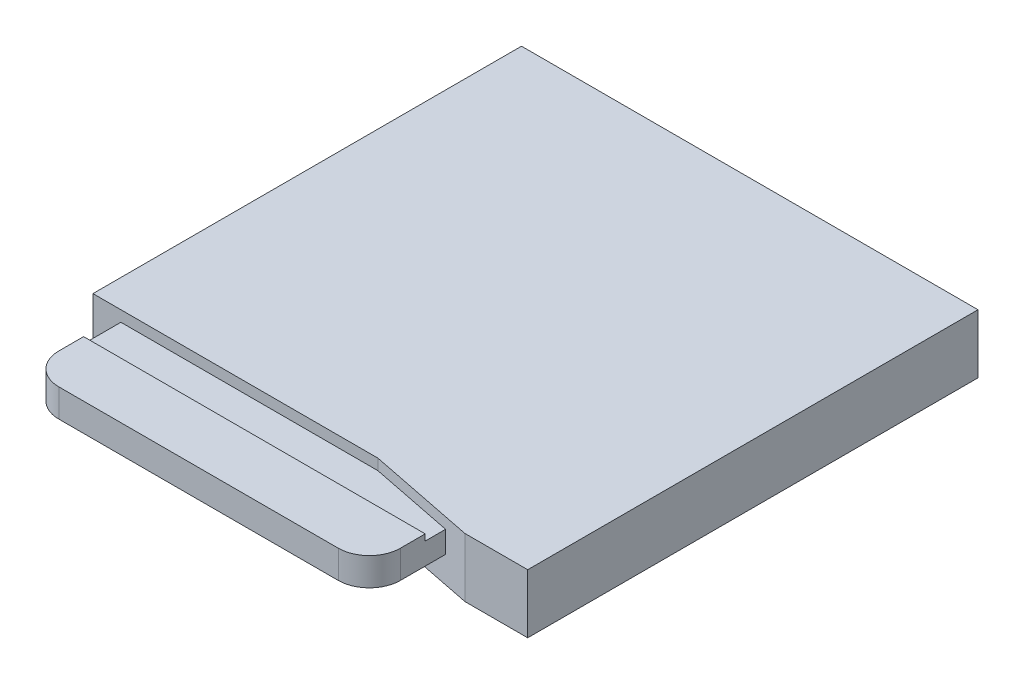
ISO-10303-21;
HEADER;
FILE_DESCRIPTION(('STEP AP214'),'2;1');
FILE_NAME('part.step','',(''),(''),'','','');
FILE_SCHEMA(('AUTOMOTIVE_DESIGN { 1 0 10303 214 1 1 1 1 }'));
ENDSEC;
DATA;
#1=APPLICATION_CONTEXT('core data for automotive mechanical design processes');
#2=APPLICATION_PROTOCOL_DEFINITION('international standard','automotive_design',2000,#1);
#3=PRODUCT_CONTEXT('',#1,'mechanical');
#4=PRODUCT('Part','Part','',(#3));
#5=PRODUCT_RELATED_PRODUCT_CATEGORY('part','',(#4));
#6=PRODUCT_DEFINITION_FORMATION('','',#4);
#7=PRODUCT_DEFINITION_CONTEXT('part definition',#1,'design');
#8=PRODUCT_DEFINITION('design','',#6,#7);
#9=PRODUCT_DEFINITION_SHAPE('','',#8);
#10=(LENGTH_UNIT() NAMED_UNIT(*) SI_UNIT(.MILLI.,.METRE.));
#11=(NAMED_UNIT(*) PLANE_ANGLE_UNIT() SI_UNIT($,.RADIAN.));
#12=(NAMED_UNIT(*) SI_UNIT($,.STERADIAN.) SOLID_ANGLE_UNIT());
#13=UNCERTAINTY_MEASURE_WITH_UNIT(LENGTH_MEASURE(1.E-05),#10,'distance_accuracy_value','');
#14=(GEOMETRIC_REPRESENTATION_CONTEXT(3) GLOBAL_UNCERTAINTY_ASSIGNED_CONTEXT((#13)) GLOBAL_UNIT_ASSIGNED_CONTEXT((#10,
#11,#12)) REPRESENTATION_CONTEXT('',''));
#15=CARTESIAN_POINT('',(0.,0.,0.));
#16=DIRECTION('',(0.,0.,1.));
#17=DIRECTION('',(1.,0.,0.));
#18=AXIS2_PLACEMENT_3D('',#15,#16,#17);
#19=CARTESIAN_POINT('',(-6.45,1.55,9.55));
#20=DIRECTION('',(0.,-1.,0.));
#21=DIRECTION('',(1.,0.,0.));
#22=AXIS2_PLACEMENT_3D('',#19,#20,#21);
#23=PLANE('',#22);
#24=DIRECTION('',(-1.,0.,0.));
#25=VECTOR('',#24,1.);
#26=CARTESIAN_POINT('',(-6.45,1.55,7.75));
#27=LINE('',#26,#25);
#28=CARTESIAN_POINT('',(4.55,1.55,7.75));
#29=VERTEX_POINT('',#28);
#30=CARTESIAN_POINT('',(-6.45,1.55,7.75));
#31=VERTEX_POINT('',#30);
#32=EDGE_CURVE('E176',#29,#31,#27,.T.);
#33=ORIENTED_EDGE('',*,*,#32,.F.);
#34=DIRECTION('',(0.,0.,-1.));
#35=VECTOR('',#34,1.);
#36=CARTESIAN_POINT('',(4.55,1.55,9.55));
#37=LINE('',#36,#35);
#38=CARTESIAN_POINT('',(4.55,1.55,7.0944663786975));
#39=VERTEX_POINT('',#38);
#40=EDGE_CURVE('E161',#29,#39,#37,.T.);
#41=ORIENTED_EDGE('',*,*,#40,.T.);
#42=DIRECTION('',(-0.980618969510465,0.,-0.195924568740712));
#43=VECTOR('',#42,1.);
#44=CARTESIAN_POINT('',(1.82489991355795,1.55,6.55));
#45=LINE('',#44,#43);
#46=CARTESIAN_POINT('',(1.82489991355794,1.55000000000001,6.55));
#47=VERTEX_POINT('',#46);
#48=EDGE_CURVE('E203',#39,#47,#45,.T.);
#49=ORIENTED_EDGE('',*,*,#48,.T.);
#50=DIRECTION('',(-1.,0.,0.));
#51=VECTOR('',#50,1.);
#52=CARTESIAN_POINT('',(-7.35,1.55,6.55));
#53=LINE('',#52,#51);
#54=CARTESIAN_POINT('',(-6.45,1.55,6.55));
#55=VERTEX_POINT('',#54);
#56=EDGE_CURVE('E278',#47,#55,#53,.T.);
#57=ORIENTED_EDGE('',*,*,#56,.T.);
#58=DIRECTION('',(0.,0.,-1.));
#59=VECTOR('',#58,1.);
#60=CARTESIAN_POINT('',(-6.45,1.55,9.55));
#61=LINE('',#60,#59);
#62=EDGE_CURVE('E185',#31,#55,#61,.T.);
#63=ORIENTED_EDGE('',*,*,#62,.F.);
#64=EDGE_LOOP('',(#33,#41,#49,#57,#63));
#65=FACE_BOUND('',#64,.T.);
#66=ADVANCED_FACE('F39',(#65),#23,.F.);
#67=CARTESIAN_POINT('',(1.82489991355794,30.1940446390294,6.55));
#68=DIRECTION('',(0.195924568740712,0.,-0.980618969510465));
#69=DIRECTION('',(-0.980618969510465,0.,-0.195924568740712));
#70=AXIS2_PLACEMENT_3D('',#67,#68,#69);
#71=PLANE('',#70);
#72=DIRECTION('',(0.980618969510465,0.,0.195924568740712));
#73=VECTOR('',#72,1.);
#74=CARTESIAN_POINT('',(1.82489991355795,0.850000000000004,6.55));
#75=LINE('',#74,#73);
#76=CARTESIAN_POINT('',(1.82489991355794,0.850000000000011,6.55));
#77=VERTEX_POINT('',#76);
#78=CARTESIAN_POINT('',(4.55,0.850000000000004,7.0944663786975));
#79=VERTEX_POINT('',#78);
#80=EDGE_CURVE('E207',#77,#79,#75,.T.);
#81=ORIENTED_EDGE('',*,*,#80,.F.);
#82=DIRECTION('',(0.,-1.,0.));
#83=VECTOR('',#82,1.);
#84=CARTESIAN_POINT('',(1.82489991355794,30.1940446390294,6.55));
#85=LINE('',#84,#83);
#86=CARTESIAN_POINT('',(1.82489991355794,0.,6.55));
#87=VERTEX_POINT('',#86);
#88=EDGE_CURVE('E233',#77,#87,#85,.T.);
#89=ORIENTED_EDGE('',*,*,#88,.T.);
#90=DIRECTION('',(-0.980618969510465,0.,-0.195924568740712));
#91=VECTOR('',#90,1.);
#92=CARTESIAN_POINT('',(1.82489991355794,0.,6.55));
#93=LINE('',#92,#91);
#94=CARTESIAN_POINT('',(5.32845887540388,0.,7.25));
#95=VERTEX_POINT('',#94);
#96=EDGE_CURVE('E212',#95,#87,#93,.T.);
#97=ORIENTED_EDGE('',*,*,#96,.F.);
#98=DIRECTION('',(0.,-1.,0.));
#99=VECTOR('',#98,1.);
#100=CARTESIAN_POINT('',(5.3284588754039,30.1940446390294,7.25));
#101=LINE('',#100,#99);
#102=CARTESIAN_POINT('',(5.3284588754039,1.90000000000001,7.25));
#103=VERTEX_POINT('',#102);
#104=EDGE_CURVE('E229',#103,#95,#101,.T.);
#105=ORIENTED_EDGE('',*,*,#104,.F.);
#106=DIRECTION('',(-0.980618969510465,0.,-0.195924568740712));
#107=VECTOR('',#106,1.);
#108=CARTESIAN_POINT('',(1.82489991355794,1.9,6.55));
#109=LINE('',#108,#107);
#110=CARTESIAN_POINT('',(1.82489991355794,1.90000000000001,6.55));
#111=VERTEX_POINT('',#110);
#112=EDGE_CURVE('E211',#103,#111,#109,.T.);
#113=ORIENTED_EDGE('',*,*,#112,.T.);
#114=EDGE_CURVE('E234',#111,#47,#85,.T.);
#115=ORIENTED_EDGE('',*,*,#114,.T.);
#116=ORIENTED_EDGE('',*,*,#48,.F.);
#117=DIRECTION('',(0.,1.,0.));
#118=VECTOR('',#117,1.);
#119=CARTESIAN_POINT('',(4.55,30.1940446390294,7.0944663786975));
#120=LINE('',#119,#118);
#121=EDGE_CURVE('E282',#79,#39,#120,.T.);
#122=ORIENTED_EDGE('',*,*,#121,.F.);
#123=EDGE_LOOP('',(#81,#89,#97,#105,#113,#115,#116,#122));
#124=FACE_BOUND('',#123,.T.);
#125=ADVANCED_FACE('F332',(#124),#71,.F.);
#126=CARTESIAN_POINT('',(-7.35,30.1940446390294,6.55));
#127=DIRECTION('',(0.,0.,-1.));
#128=DIRECTION('',(-1.,0.,0.));
#129=AXIS2_PLACEMENT_3D('',#126,#127,#128);
#130=PLANE('',#129);
#131=DIRECTION('',(1.,0.,0.));
#132=VECTOR('',#131,1.);
#133=CARTESIAN_POINT('',(-6.45,0.850000000000002,6.55));
#134=LINE('',#133,#132);
#135=CARTESIAN_POINT('',(-6.45,0.850000000000004,6.55));
#136=VERTEX_POINT('',#135);
#137=EDGE_CURVE('E186',#136,#77,#134,.T.);
#138=ORIENTED_EDGE('',*,*,#137,.F.);
#139=DIRECTION('',(0.,-1.,0.));
#140=VECTOR('',#139,1.);
#141=CARTESIAN_POINT('',(-6.45,1.55,6.55));
#142=LINE('',#141,#140);
#143=EDGE_CURVE('E165',#55,#136,#142,.T.);
#144=ORIENTED_EDGE('',*,*,#143,.F.);
#145=ORIENTED_EDGE('',*,*,#56,.F.);
#146=ORIENTED_EDGE('',*,*,#114,.F.);
#147=DIRECTION('',(-1.,0.,0.));
#148=VECTOR('',#147,1.);
#149=CARTESIAN_POINT('',(-7.35,1.9,6.55));
#150=LINE('',#149,#148);
#151=CARTESIAN_POINT('',(-7.35,1.90000000000001,6.55));
#152=VERTEX_POINT('',#151);
#153=EDGE_CURVE('E221',#111,#152,#150,.T.);
#154=ORIENTED_EDGE('',*,*,#153,.T.);
#155=DIRECTION('',(0.,-1.,0.));
#156=VECTOR('',#155,1.);
#157=CARTESIAN_POINT('',(-7.35,30.1940446390294,6.55));
#158=LINE('',#157,#156);
#159=CARTESIAN_POINT('',(-7.35,0.,6.55));
#160=VERTEX_POINT('',#159);
#161=EDGE_CURVE('E216',#152,#160,#158,.T.);
#162=ORIENTED_EDGE('',*,*,#161,.T.);
#163=DIRECTION('',(-1.,0.,0.));
#164=VECTOR('',#163,1.);
#165=CARTESIAN_POINT('',(-7.35,0.,6.55));
#166=LINE('',#165,#164);
#167=EDGE_CURVE('E217',#87,#160,#166,.T.);
#168=ORIENTED_EDGE('',*,*,#167,.F.);
#169=ORIENTED_EDGE('',*,*,#88,.F.);
#170=EDGE_LOOP('',(#138,#144,#145,#146,#154,#162,#168,#169));
#171=FACE_BOUND('',#170,.T.);
#172=ADVANCED_FACE('F338',(#171),#130,.F.);
#173=CARTESIAN_POINT('',(0.,0.,0.));
#174=DIRECTION('',(0.,-1.,0.));
#175=DIRECTION('',(0.,0.,-1.));
#176=AXIS2_PLACEMENT_3D('',#173,#174,#175);
#177=PLANE('',#176);
#178=CARTESIAN_POINT('',(3.05,0.,3.25));
#179=DIRECTION('',(0.,-1.,0.));
#180=DIRECTION('',(0.,0.,-1.));
#181=AXIS2_PLACEMENT_3D('',#178,#179,#180);
#182=CIRCLE('',#181,0.4);
#183=CARTESIAN_POINT('',(3.05,0.,2.85));
#184=VERTEX_POINT('',#183);
#185=EDGE_CURVE('E430',#184,#184,#182,.T.);
#186=ORIENTED_EDGE('',*,*,#185,.F.);
#187=EDGE_LOOP('',(#186));
#188=FACE_BOUND('',#187,.T.);
#189=CARTESIAN_POINT('',(-4.95,0.,3.25));
#190=DIRECTION('',(0.,-1.,0.));
#191=DIRECTION('',(0.,0.,-1.));
#192=AXIS2_PLACEMENT_3D('',#189,#190,#191);
#193=CIRCLE('',#192,0.4);
#194=CARTESIAN_POINT('',(-4.95,0.,2.85));
#195=VERTEX_POINT('',#194);
#196=EDGE_CURVE('E179',#195,#195,#193,.T.);
#197=ORIENTED_EDGE('',*,*,#196,.F.);
#198=EDGE_LOOP('',(#197));
#199=FACE_BOUND('',#198,.T.);
#200=ORIENTED_EDGE('',*,*,#96,.T.);
#201=ORIENTED_EDGE('',*,*,#167,.T.);
#202=DIRECTION('',(0.,0.,1.));
#203=VECTOR('',#202,1.);
#204=CARTESIAN_POINT('',(-7.35,0.,7.25));
#205=LINE('',#204,#203);
#206=CARTESIAN_POINT('',(-7.35,0.,-7.25));
#207=VERTEX_POINT('',#206);
#208=EDGE_CURVE('E261',#207,#160,#205,.T.);
#209=ORIENTED_EDGE('',*,*,#208,.F.);
#210=DIRECTION('',(-1.,0.,0.));
#211=VECTOR('',#210,1.);
#212=CARTESIAN_POINT('',(-7.35,0.,-7.25));
#213=LINE('',#212,#211);
#214=CARTESIAN_POINT('',(7.35,0.,-7.25));
#215=VERTEX_POINT('',#214);
#216=EDGE_CURVE('E258',#215,#207,#213,.T.);
#217=ORIENTED_EDGE('',*,*,#216,.F.);
#218=DIRECTION('',(0.,0.,-1.));
#219=VECTOR('',#218,1.);
#220=CARTESIAN_POINT('',(7.35,0.,7.25));
#221=LINE('',#220,#219);
#222=CARTESIAN_POINT('',(7.35,0.,7.25));
#223=VERTEX_POINT('',#222);
#224=EDGE_CURVE('E238',#223,#215,#221,.T.);
#225=ORIENTED_EDGE('',*,*,#224,.F.);
#226=DIRECTION('',(1.,0.,0.));
#227=VECTOR('',#226,1.);
#228=CARTESIAN_POINT('',(-7.35,0.,7.25));
#229=LINE('',#228,#227);
#230=EDGE_CURVE('E244',#95,#223,#229,.T.);
#231=ORIENTED_EDGE('',*,*,#230,.F.);
#232=EDGE_LOOP('',(#200,#201,#209,#217,#225,#231));
#233=FACE_BOUND('',#232,.T.);
#234=ADVANCED_FACE('F356',(#188,#199,#233),#177,.T.);
#235=CARTESIAN_POINT('',(7.35,1.9,7.25));
#236=DIRECTION('',(-1.,0.,0.));
#237=DIRECTION('',(0.,0.,1.));
#238=AXIS2_PLACEMENT_3D('',#235,#236,#237);
#239=PLANE('',#238);
#240=ORIENTED_EDGE('',*,*,#224,.T.);
#241=DIRECTION('',(0.,-1.,0.));
#242=VECTOR('',#241,1.);
#243=CARTESIAN_POINT('',(7.35,1.9,-7.25));
#244=LINE('',#243,#242);
#245=CARTESIAN_POINT('',(7.35,1.9,-7.25));
#246=VERTEX_POINT('',#245);
#247=EDGE_CURVE('E274',#246,#215,#244,.T.);
#248=ORIENTED_EDGE('',*,*,#247,.F.);
#249=DIRECTION('',(0.,0.,-1.));
#250=VECTOR('',#249,1.);
#251=CARTESIAN_POINT('',(7.35,1.9,7.25));
#252=LINE('',#251,#250);
#253=CARTESIAN_POINT('',(7.35,1.9,7.25));
#254=VERTEX_POINT('',#253);
#255=EDGE_CURVE('E239',#254,#246,#252,.T.);
#256=ORIENTED_EDGE('',*,*,#255,.F.);
#257=DIRECTION('',(0.,-1.,0.));
#258=VECTOR('',#257,1.);
#259=CARTESIAN_POINT('',(7.35,1.9,7.25));
#260=LINE('',#259,#258);
#261=EDGE_CURVE('E254',#254,#223,#260,.T.);
#262=ORIENTED_EDGE('',*,*,#261,.T.);
#263=EDGE_LOOP('',(#240,#248,#256,#262));
#264=FACE_BOUND('',#263,.T.);
#265=ADVANCED_FACE('F365',(#264),#239,.F.);
#266=CARTESIAN_POINT('',(-7.35,1.9,-7.25));
#267=DIRECTION('',(0.,0.,1.));
#268=DIRECTION('',(1.,0.,0.));
#269=AXIS2_PLACEMENT_3D('',#266,#267,#268);
#270=PLANE('',#269);
#271=ORIENTED_EDGE('',*,*,#216,.T.);
#272=DIRECTION('',(0.,-1.,0.));
#273=VECTOR('',#272,1.);
#274=CARTESIAN_POINT('',(-7.35,1.9,-7.25));
#275=LINE('',#274,#273);
#276=CARTESIAN_POINT('',(-7.35,1.9,-7.25));
#277=VERTEX_POINT('',#276);
#278=EDGE_CURVE('E270',#277,#207,#275,.T.);
#279=ORIENTED_EDGE('',*,*,#278,.F.);
#280=DIRECTION('',(-1.,0.,0.));
#281=VECTOR('',#280,1.);
#282=CARTESIAN_POINT('',(-7.35,1.9,-7.25));
#283=LINE('',#282,#281);
#284=EDGE_CURVE('E243',#246,#277,#283,.T.);
#285=ORIENTED_EDGE('',*,*,#284,.F.);
#286=ORIENTED_EDGE('',*,*,#247,.T.);
#287=EDGE_LOOP('',(#271,#279,#285,#286));
#288=FACE_BOUND('',#287,.T.);
#289=ADVANCED_FACE('F373',(#288),#270,.F.);
#290=CARTESIAN_POINT('',(-7.35,1.9,7.25));
#291=DIRECTION('',(1.,0.,0.));
#292=DIRECTION('',(0.,0.,-1.));
#293=AXIS2_PLACEMENT_3D('',#290,#291,#292);
#294=PLANE('',#293);
#295=ORIENTED_EDGE('',*,*,#208,.T.);
#296=ORIENTED_EDGE('',*,*,#161,.F.);
#297=DIRECTION('',(0.,0.,1.));
#298=VECTOR('',#297,1.);
#299=CARTESIAN_POINT('',(-7.35,1.9,7.25));
#300=LINE('',#299,#298);
#301=EDGE_CURVE('E247',#277,#152,#300,.T.);
#302=ORIENTED_EDGE('',*,*,#301,.F.);
#303=ORIENTED_EDGE('',*,*,#278,.T.);
#304=EDGE_LOOP('',(#295,#296,#302,#303));
#305=FACE_BOUND('',#304,.T.);
#306=ADVANCED_FACE('F369',(#305),#294,.F.);
#307=CARTESIAN_POINT('',(-7.35,1.9,7.25));
#308=DIRECTION('',(0.,0.,-1.));
#309=DIRECTION('',(-1.,0.,0.));
#310=AXIS2_PLACEMENT_3D('',#307,#308,#309);
#311=PLANE('',#310);
#312=DIRECTION('',(1.,0.,0.));
#313=VECTOR('',#312,1.);
#314=CARTESIAN_POINT('',(-7.35,1.9,7.25));
#315=LINE('',#314,#313);
#316=EDGE_CURVE('E251',#103,#254,#315,.T.);
#317=ORIENTED_EDGE('',*,*,#316,.F.);
#318=ORIENTED_EDGE('',*,*,#104,.T.);
#319=ORIENTED_EDGE('',*,*,#230,.T.);
#320=ORIENTED_EDGE('',*,*,#261,.F.);
#321=EDGE_LOOP('',(#317,#318,#319,#320));
#322=FACE_BOUND('',#321,.T.);
#323=ADVANCED_FACE('F361',(#322),#311,.F.);
#324=CARTESIAN_POINT('',(0.,1.9,0.));
#325=DIRECTION('',(0.,-1.,0.));
#326=DIRECTION('',(0.,0.,-1.));
#327=AXIS2_PLACEMENT_3D('',#324,#325,#326);
#328=PLANE('',#327);
#329=ORIENTED_EDGE('',*,*,#153,.F.);
#330=ORIENTED_EDGE('',*,*,#112,.F.);
#331=ORIENTED_EDGE('',*,*,#316,.T.);
#332=ORIENTED_EDGE('',*,*,#255,.T.);
#333=ORIENTED_EDGE('',*,*,#284,.T.);
#334=ORIENTED_EDGE('',*,*,#301,.T.);
#335=EDGE_LOOP('',(#329,#330,#331,#332,#333,#334));
#336=FACE_BOUND('',#335,.T.);
#337=ADVANCED_FACE('F348',(#336),#328,.F.);
#338=CARTESIAN_POINT('',(4.55,1.55,9.55));
#339=DIRECTION('',(-1.,0.,0.));
#340=DIRECTION('',(0.,0.,1.));
#341=AXIS2_PLACEMENT_3D('',#338,#339,#340);
#342=PLANE('',#341);
#343=DIRECTION('',(0.,0.,-1.));
#344=VECTOR('',#343,1.);
#345=CARTESIAN_POINT('',(4.55,1.75,9.55));
#346=LINE('',#345,#344);
#347=CARTESIAN_POINT('',(4.55,1.75,8.55));
#348=VERTEX_POINT('',#347);
#349=CARTESIAN_POINT('',(4.55,1.75,7.75));
#350=VERTEX_POINT('',#349);
#351=EDGE_CURVE('E146',#348,#350,#346,.T.);
#352=ORIENTED_EDGE('',*,*,#351,.F.);
#353=DIRECTION('',(0.,1.,0.));
#354=VECTOR('',#353,1.);
#355=CARTESIAN_POINT('',(4.55,0.850000000000004,8.55));
#356=LINE('',#355,#354);
#357=CARTESIAN_POINT('',(4.55,0.850000000000004,8.55));
#358=VERTEX_POINT('',#357);
#359=EDGE_CURVE('E306',#348,#358,#356,.F.);
#360=ORIENTED_EDGE('',*,*,#359,.T.);
#361=DIRECTION('',(0.,0.,-1.));
#362=VECTOR('',#361,1.);
#363=CARTESIAN_POINT('',(4.55,0.850000000000004,9.55));
#364=LINE('',#363,#362);
#365=EDGE_CURVE('E197',#358,#79,#364,.T.);
#366=ORIENTED_EDGE('',*,*,#365,.T.);
#367=ORIENTED_EDGE('',*,*,#121,.T.);
#368=ORIENTED_EDGE('',*,*,#40,.F.);
#369=DIRECTION('',(0.,-1.,0.));
#370=VECTOR('',#369,1.);
#371=CARTESIAN_POINT('',(4.55,1.75,7.75));
#372=LINE('',#371,#370);
#373=EDGE_CURVE('E158',#350,#29,#372,.T.);
#374=ORIENTED_EDGE('',*,*,#373,.F.);
#375=EDGE_LOOP('',(#352,#360,#366,#367,#368,#374));
#376=FACE_BOUND('',#375,.T.);
#377=ADVANCED_FACE('F159',(#376),#342,.F.);
#378=CARTESIAN_POINT('',(-6.45,0.850000000000002,9.55));
#379=DIRECTION('',(0.,1.,0.));
#380=DIRECTION('',(-1.,0.,0.));
#381=AXIS2_PLACEMENT_3D('',#378,#379,#380);
#382=PLANE('',#381);
#383=DIRECTION('',(1.,0.,0.));
#384=VECTOR('',#383,1.);
#385=CARTESIAN_POINT('',(-6.45,0.850000000000002,9.55));
#386=LINE('',#385,#384);
#387=CARTESIAN_POINT('',(-5.45,0.850000000000003,9.55));
#388=VERTEX_POINT('',#387);
#389=CARTESIAN_POINT('',(3.55,0.850000000000004,9.55));
#390=VERTEX_POINT('',#389);
#391=EDGE_CURVE('E181',#388,#390,#386,.T.);
#392=ORIENTED_EDGE('',*,*,#391,.F.);
#393=CARTESIAN_POINT('',(-5.45,0.850000000000003,8.55));
#394=DIRECTION('',(0.,1.,0.));
#395=DIRECTION('',(-1.,0.,0.));
#396=AXIS2_PLACEMENT_3D('',#393,#394,#395);
#397=CIRCLE('',#396,1.);
#398=CARTESIAN_POINT('',(-6.45,0.850000000000002,8.55));
#399=VERTEX_POINT('',#398);
#400=EDGE_CURVE('E296',#388,#399,#397,.F.);
#401=ORIENTED_EDGE('',*,*,#400,.T.);
#402=DIRECTION('',(0.,0.,-1.));
#403=VECTOR('',#402,1.);
#404=CARTESIAN_POINT('',(-6.45,0.850000000000002,9.55));
#405=LINE('',#404,#403);
#406=EDGE_CURVE('E200',#399,#136,#405,.T.);
#407=ORIENTED_EDGE('',*,*,#406,.T.);
#408=ORIENTED_EDGE('',*,*,#137,.T.);
#409=ORIENTED_EDGE('',*,*,#80,.T.);
#410=ORIENTED_EDGE('',*,*,#365,.F.);
#411=CARTESIAN_POINT('',(3.55,0.850000000000004,8.55));
#412=DIRECTION('',(0.,1.,0.));
#413=DIRECTION('',(-1.,0.,0.));
#414=AXIS2_PLACEMENT_3D('',#411,#412,#413);
#415=CIRCLE('',#414,1.);
#416=EDGE_CURVE('E293',#358,#390,#415,.F.);
#417=ORIENTED_EDGE('',*,*,#416,.T.);
#418=EDGE_LOOP('',(#392,#401,#407,#408,#409,#410,#417));
#419=FACE_BOUND('',#418,.T.);
#420=ADVANCED_FACE('F347',(#419),#382,.F.);
#421=CARTESIAN_POINT('',(-6.45,1.55,9.55));
#422=DIRECTION('',(1.,0.,0.));
#423=DIRECTION('',(0.,0.,-1.));
#424=AXIS2_PLACEMENT_3D('',#421,#422,#423);
#425=PLANE('',#424);
#426=ORIENTED_EDGE('',*,*,#406,.F.);
#427=DIRECTION('',(0.,-1.,0.));
#428=VECTOR('',#427,1.);
#429=CARTESIAN_POINT('',(-6.45,1.75,8.55));
#430=LINE('',#429,#428);
#431=CARTESIAN_POINT('',(-6.45,1.75,8.55));
#432=VERTEX_POINT('',#431);
#433=EDGE_CURVE('E63',#399,#432,#430,.F.);
#434=ORIENTED_EDGE('',*,*,#433,.T.);
#435=DIRECTION('',(0.,0.,1.));
#436=VECTOR('',#435,1.);
#437=CARTESIAN_POINT('',(-6.45,1.75,9.55));
#438=LINE('',#437,#436);
#439=CARTESIAN_POINT('',(-6.45,1.75,7.75));
#440=VERTEX_POINT('',#439);
#441=EDGE_CURVE('E178',#440,#432,#438,.T.);
#442=ORIENTED_EDGE('',*,*,#441,.F.);
#443=DIRECTION('',(0.,-1.,0.));
#444=VECTOR('',#443,1.);
#445=CARTESIAN_POINT('',(-6.45,1.75,7.75));
#446=LINE('',#445,#444);
#447=EDGE_CURVE('E166',#440,#31,#446,.T.);
#448=ORIENTED_EDGE('',*,*,#447,.T.);
#449=ORIENTED_EDGE('',*,*,#62,.T.);
#450=ORIENTED_EDGE('',*,*,#143,.T.);
#451=EDGE_LOOP('',(#426,#434,#442,#448,#449,#450));
#452=FACE_BOUND('',#451,.T.);
#453=ADVANCED_FACE('F351',(#452),#425,.F.);
#454=CARTESIAN_POINT('',(0.,0.,9.55));
#455=DIRECTION('',(0.,0.,1.));
#456=DIRECTION('',(1.,0.,0.));
#457=AXIS2_PLACEMENT_3D('',#454,#455,#456);
#458=PLANE('',#457);
#459=DIRECTION('',(1.,0.,0.));
#460=VECTOR('',#459,1.);
#461=CARTESIAN_POINT('',(-6.45,1.75,9.55));
#462=LINE('',#461,#460);
#463=CARTESIAN_POINT('',(-5.45,1.75,9.55));
#464=VERTEX_POINT('',#463);
#465=CARTESIAN_POINT('',(3.55,1.75,9.55));
#466=VERTEX_POINT('',#465);
#467=EDGE_CURVE('E155',#464,#466,#462,.T.);
#468=ORIENTED_EDGE('',*,*,#467,.F.);
#469=DIRECTION('',(0.,-1.,0.));
#470=VECTOR('',#469,1.);
#471=CARTESIAN_POINT('',(-5.45,0.850000000000002,9.55));
#472=LINE('',#471,#470);
#473=EDGE_CURVE('E289',#464,#388,#472,.T.);
#474=ORIENTED_EDGE('',*,*,#473,.T.);
#475=ORIENTED_EDGE('',*,*,#391,.T.);
#476=DIRECTION('',(0.,1.,0.));
#477=VECTOR('',#476,1.);
#478=CARTESIAN_POINT('',(3.55,1.75,9.55));
#479=LINE('',#478,#477);
#480=EDGE_CURVE('E285',#390,#466,#479,.T.);
#481=ORIENTED_EDGE('',*,*,#480,.T.);
#482=EDGE_LOOP('',(#468,#474,#475,#481));
#483=FACE_BOUND('',#482,.T.);
#484=ADVANCED_FACE('F343',(#483),#458,.T.);
#485=CARTESIAN_POINT('',(-6.45,1.75,7.75));
#486=DIRECTION('',(0.,0.,1.));
#487=DIRECTION('',(1.,0.,0.));
#488=AXIS2_PLACEMENT_3D('',#485,#486,#487);
#489=PLANE('',#488);
#490=ORIENTED_EDGE('',*,*,#32,.T.);
#491=ORIENTED_EDGE('',*,*,#447,.F.);
#492=DIRECTION('',(-1.,0.,0.));
#493=VECTOR('',#492,1.);
#494=CARTESIAN_POINT('',(-6.45,1.75,7.75));
#495=LINE('',#494,#493);
#496=EDGE_CURVE('E150',#350,#440,#495,.T.);
#497=ORIENTED_EDGE('',*,*,#496,.F.);
#498=ORIENTED_EDGE('',*,*,#373,.T.);
#499=EDGE_LOOP('',(#490,#491,#497,#498));
#500=FACE_BOUND('',#499,.T.);
#501=ADVANCED_FACE('F168',(#500),#489,.F.);
#502=CARTESIAN_POINT('',(0.,1.75,0.));
#503=DIRECTION('',(0.,-1.,0.));
#504=DIRECTION('',(1.,0.,0.));
#505=AXIS2_PLACEMENT_3D('',#502,#503,#504);
#506=PLANE('',#505);
#507=ORIENTED_EDGE('',*,*,#441,.T.);
#508=CARTESIAN_POINT('',(-5.45,1.75,8.55));
#509=DIRECTION('',(0.,-1.,0.));
#510=DIRECTION('',(1.,0.,0.));
#511=AXIS2_PLACEMENT_3D('',#508,#509,#510);
#512=CIRCLE('',#511,1.);
#513=EDGE_CURVE('E303',#432,#464,#512,.F.);
#514=ORIENTED_EDGE('',*,*,#513,.T.);
#515=ORIENTED_EDGE('',*,*,#467,.T.);
#516=CARTESIAN_POINT('',(3.55,1.75,8.55));
#517=DIRECTION('',(0.,-1.,0.));
#518=DIRECTION('',(1.,0.,0.));
#519=AXIS2_PLACEMENT_3D('',#516,#517,#518);
#520=CIRCLE('',#519,1.);
#521=EDGE_CURVE('E55',#466,#348,#520,.F.);
#522=ORIENTED_EDGE('',*,*,#521,.T.);
#523=ORIENTED_EDGE('',*,*,#351,.T.);
#524=ORIENTED_EDGE('',*,*,#496,.T.);
#525=EDGE_LOOP('',(#507,#514,#515,#522,#523,#524));
#526=FACE_BOUND('',#525,.T.);
#527=ADVANCED_FACE('F148',(#526),#506,.F.);
#528=CARTESIAN_POINT('',(-5.45,0.,8.55));
#529=DIRECTION('',(0.,1.,0.));
#530=DIRECTION('',(0.,0.,1.));
#531=AXIS2_PLACEMENT_3D('',#528,#529,#530);
#532=CYLINDRICAL_SURFACE('',#531,1.);
#533=ORIENTED_EDGE('',*,*,#513,.F.);
#534=ORIENTED_EDGE('',*,*,#433,.F.);
#535=ORIENTED_EDGE('',*,*,#400,.F.);
#536=ORIENTED_EDGE('',*,*,#473,.F.);
#537=EDGE_LOOP('',(#533,#534,#535,#536));
#538=FACE_BOUND('',#537,.T.);
#539=ADVANCED_FACE('F381',(#538),#532,.T.);
#540=CARTESIAN_POINT('',(3.55,0.,8.55));
#541=DIRECTION('',(0.,-1.,0.));
#542=DIRECTION('',(0.,0.,-1.));
#543=AXIS2_PLACEMENT_3D('',#540,#541,#542);
#544=CYLINDRICAL_SURFACE('',#543,1.);
#545=ORIENTED_EDGE('',*,*,#416,.F.);
#546=ORIENTED_EDGE('',*,*,#359,.F.);
#547=ORIENTED_EDGE('',*,*,#521,.F.);
#548=ORIENTED_EDGE('',*,*,#480,.F.);
#549=EDGE_LOOP('',(#545,#546,#547,#548));
#550=FACE_BOUND('',#549,.T.);
#551=ADVANCED_FACE('F384',(#550),#544,.T.);
#552=CARTESIAN_POINT('',(-4.95,-0.55,3.25));
#553=DIRECTION('',(0.,1.,0.));
#554=DIRECTION('',(0.,0.,1.));
#555=AXIS2_PLACEMENT_3D('',#552,#553,#554);
#556=CYLINDRICAL_SURFACE('',#555,0.4);
#557=CARTESIAN_POINT('',(-4.95,-0.45,3.25));
#558=DIRECTION('',(0.,-1.,0.));
#559=DIRECTION('',(0.,0.,-1.));
#560=AXIS2_PLACEMENT_3D('',#557,#558,#559);
#561=CIRCLE('',#560,0.4);
#562=CARTESIAN_POINT('',(-4.95,-0.45,2.85));
#563=VERTEX_POINT('',#562);
#564=EDGE_CURVE('E11',#563,#563,#561,.F.);
#565=ORIENTED_EDGE('',*,*,#564,.T.);
#566=EDGE_LOOP('',(#565));
#567=FACE_BOUND('',#566,.T.);
#568=ORIENTED_EDGE('',*,*,#196,.T.);
#569=EDGE_LOOP('',(#568));
#570=FACE_BOUND('',#569,.T.);
#571=ADVANCED_FACE('F387',(#567,#570),#556,.T.);
#572=CARTESIAN_POINT('',(-4.95,-0.55,3.25));
#573=DIRECTION('',(0.,-1.,0.));
#574=DIRECTION('',(0.,0.,-1.));
#575=AXIS2_PLACEMENT_3D('',#572,#573,#574);
#576=PLANE('',#575);
#577=CARTESIAN_POINT('',(-4.95,-0.55,3.25));
#578=DIRECTION('',(0.,-1.,0.));
#579=DIRECTION('',(0.,0.,-1.));
#580=AXIS2_PLACEMENT_3D('',#577,#578,#579);
#581=CIRCLE('',#580,0.3);
#582=CARTESIAN_POINT('',(-4.95,-0.55,2.95));
#583=VERTEX_POINT('',#582);
#584=EDGE_CURVE('E48',#583,#583,#581,.T.);
#585=ORIENTED_EDGE('',*,*,#584,.T.);
#586=EDGE_LOOP('',(#585));
#587=FACE_BOUND('',#586,.T.);
#588=ADVANCED_FACE('F320',(#587),#576,.T.);
#589=CARTESIAN_POINT('',(3.05,-0.55,3.25));
#590=DIRECTION('',(0.,1.,0.));
#591=DIRECTION('',(0.,0.,1.));
#592=AXIS2_PLACEMENT_3D('',#589,#590,#591);
#593=CYLINDRICAL_SURFACE('',#592,0.4);
#594=CARTESIAN_POINT('',(3.05,-0.45,3.25));
#595=DIRECTION('',(0.,-1.,0.));
#596=DIRECTION('',(0.,0.,-1.));
#597=AXIS2_PLACEMENT_3D('',#594,#595,#596);
#598=CIRCLE('',#597,0.4);
#599=CARTESIAN_POINT('',(3.05,-0.45,2.85));
#600=VERTEX_POINT('',#599);
#601=EDGE_CURVE('E313',#600,#600,#598,.F.);
#602=ORIENTED_EDGE('',*,*,#601,.T.);
#603=EDGE_LOOP('',(#602));
#604=FACE_BOUND('',#603,.T.);
#605=ORIENTED_EDGE('',*,*,#185,.T.);
#606=EDGE_LOOP('',(#605));
#607=FACE_BOUND('',#606,.T.);
#608=ADVANCED_FACE('F435',(#604,#607),#593,.T.);
#609=CARTESIAN_POINT('',(3.05,-0.55,3.25));
#610=DIRECTION('',(0.,-1.,0.));
#611=DIRECTION('',(0.,0.,-1.));
#612=AXIS2_PLACEMENT_3D('',#609,#610,#611);
#613=PLANE('',#612);
#614=CARTESIAN_POINT('',(3.05,-0.55,3.25));
#615=DIRECTION('',(0.,-1.,0.));
#616=DIRECTION('',(0.,0.,-1.));
#617=AXIS2_PLACEMENT_3D('',#614,#615,#616);
#618=CIRCLE('',#617,0.3);
#619=CARTESIAN_POINT('',(3.05,-0.55,2.95));
#620=VERTEX_POINT('',#619);
#621=EDGE_CURVE('E309',#620,#620,#618,.T.);
#622=ORIENTED_EDGE('',*,*,#621,.T.);
#623=EDGE_LOOP('',(#622));
#624=FACE_BOUND('',#623,.T.);
#625=ADVANCED_FACE('F328',(#624),#613,.T.);
#626=CARTESIAN_POINT('',(3.05,-0.45,3.25));
#627=DIRECTION('',(0.,-1.,0.));
#628=DIRECTION('',(0.,0.,-1.));
#629=AXIS2_PLACEMENT_3D('',#626,#627,#628);
#630=TOROIDAL_SURFACE('',#629,0.3,0.1);
#631=ORIENTED_EDGE('',*,*,#601,.F.);
#632=EDGE_LOOP('',(#631));
#633=FACE_BOUND('',#632,.T.);
#634=ORIENTED_EDGE('',*,*,#621,.F.);
#635=EDGE_LOOP('',(#634));
#636=FACE_BOUND('',#635,.T.);
#637=ADVANCED_FACE('F323',(#633,#636),#630,.T.);
#638=CARTESIAN_POINT('',(-4.95,-0.45,3.25));
#639=DIRECTION('',(0.,-1.,0.));
#640=DIRECTION('',(0.,0.,-1.));
#641=AXIS2_PLACEMENT_3D('',#638,#639,#640);
#642=TOROIDAL_SURFACE('',#641,0.3,0.1);
#643=ORIENTED_EDGE('',*,*,#564,.F.);
#644=EDGE_LOOP('',(#643));
#645=FACE_BOUND('',#644,.T.);
#646=ORIENTED_EDGE('',*,*,#584,.F.);
#647=EDGE_LOOP('',(#646));
#648=FACE_BOUND('',#647,.T.);
#649=ADVANCED_FACE('F41',(#645,#648),#642,.T.);
#650=CLOSED_SHELL('',(#66,#125,#172,#234,#265,#289,#306,#323,#337,#377,#420,#453,#484,#501,#527,
#539,#551,#571,#588,#608,#625,#637,#649));
#651=MANIFOLD_SOLID_BREP('B2',#650);
#652=ADVANCED_BREP_SHAPE_REPRESENTATION('',(#18,#651),#14);
#653=SHAPE_DEFINITION_REPRESENTATION(#9,#652);
ENDSEC;
END-ISO-10303-21;
